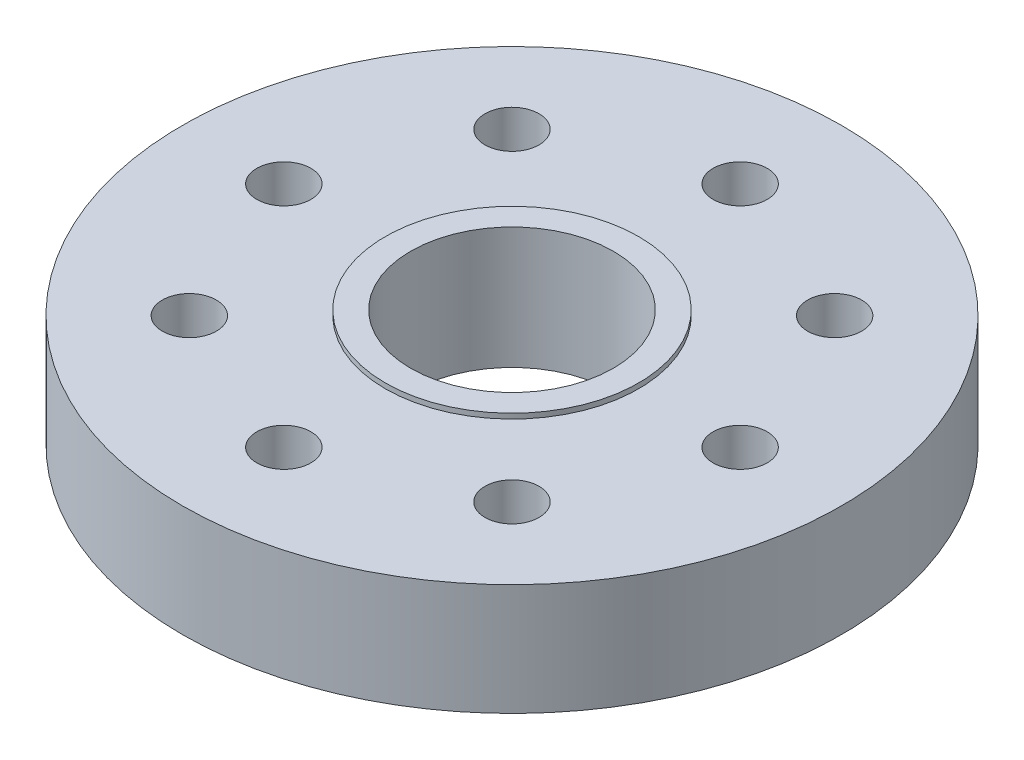
ISO-10303-21;
HEADER;
FILE_DESCRIPTION(('STEP AP214'),'2;1');
FILE_NAME('part.step','',(''),(''),'','','');
FILE_SCHEMA(('AUTOMOTIVE_DESIGN { 1 0 10303 214 1 1 1 1 }'));
ENDSEC;
DATA;
#1=APPLICATION_CONTEXT('core data for automotive mechanical design processes');
#2=APPLICATION_PROTOCOL_DEFINITION('international standard','automotive_design',2000,#1);
#3=PRODUCT_CONTEXT('',#1,'mechanical');
#4=PRODUCT('Part','Part','',(#3));
#5=PRODUCT_RELATED_PRODUCT_CATEGORY('part','',(#4));
#6=PRODUCT_DEFINITION_FORMATION('','',#4);
#7=PRODUCT_DEFINITION_CONTEXT('part definition',#1,'design');
#8=PRODUCT_DEFINITION('design','',#6,#7);
#9=PRODUCT_DEFINITION_SHAPE('','',#8);
#10=(LENGTH_UNIT() NAMED_UNIT(*) SI_UNIT(.MILLI.,.METRE.));
#11=(NAMED_UNIT(*) PLANE_ANGLE_UNIT() SI_UNIT($,.RADIAN.));
#12=(NAMED_UNIT(*) SI_UNIT($,.STERADIAN.) SOLID_ANGLE_UNIT());
#13=UNCERTAINTY_MEASURE_WITH_UNIT(LENGTH_MEASURE(1.E-05),#10,'distance_accuracy_value','');
#14=(GEOMETRIC_REPRESENTATION_CONTEXT(3) GLOBAL_UNCERTAINTY_ASSIGNED_CONTEXT((#13)) GLOBAL_UNIT_ASSIGNED_CONTEXT((#10,
#11,#12)) REPRESENTATION_CONTEXT('',''));
#15=CARTESIAN_POINT('',(0.,0.,0.));
#16=DIRECTION('',(0.,0.,1.));
#17=DIRECTION('',(1.,0.,0.));
#18=AXIS2_PLACEMENT_3D('',#15,#16,#17);
#19=CARTESIAN_POINT('',(0.,-1.65,0.));
#20=DIRECTION('',(0.,1.,0.));
#21=DIRECTION('',(0.,0.,1.));
#22=AXIS2_PLACEMENT_3D('',#19,#20,#21);
#23=PLANE('',#22);
#24=CARTESIAN_POINT('',(-4.7729707730092,-1.65,-4.7729707730092));
#25=DIRECTION('',(0.,1.,0.));
#26=DIRECTION('',(0.,0.,1.));
#27=AXIS2_PLACEMENT_3D('',#24,#25,#26);
#28=CIRCLE('',#27,0.8);
#29=CARTESIAN_POINT('',(-4.7729707730092,-1.65,-3.97297077300919));
#30=VERTEX_POINT('',#29);
#31=EDGE_CURVE('E261',#30,#30,#28,.T.);
#32=ORIENTED_EDGE('',*,*,#31,.T.);
#33=EDGE_LOOP('',(#32));
#34=FACE_BOUND('',#33,.T.);
#35=CARTESIAN_POINT('',(0.,-1.65,0.));
#36=DIRECTION('',(0.,-1.,0.));
#37=DIRECTION('',(0.,0.,-1.));
#38=AXIS2_PLACEMENT_3D('',#35,#36,#37);
#39=CIRCLE('',#38,4.4);
#40=CARTESIAN_POINT('',(-3.57052525047409,-1.65,-2.57125444787694));
#41=VERTEX_POINT('',#40);
#42=CARTESIAN_POINT('',(-3.02772373375921,-1.65,-3.19263041895413));
#43=VERTEX_POINT('',#42);
#44=EDGE_CURVE('E147',#41,#43,#39,.T.);
#45=ORIENTED_EDGE('',*,*,#44,.F.);
#46=CARTESIAN_POINT('',(-4.77297077300901,-1.65,-4.16941738241638));
#47=DIRECTION('',(0.,-1.,0.));
#48=DIRECTION('',(0.,0.,-1.));
#49=AXIS2_PLACEMENT_3D('',#46,#47,#48);
#50=CIRCLE('',#49,2.);
#51=EDGE_CURVE('E133',#41,#43,#50,.T.);
#52=ORIENTED_EDGE('',*,*,#51,.T.);
#53=EDGE_LOOP('',(#45,#52));
#54=FACE_BOUND('',#53,.T.);
#55=ADVANCED_FACE('F36',(#34,#54),#23,.F.);
#56=CARTESIAN_POINT('',(0.,-1.65,-6.75));
#57=DIRECTION('',(0.,1.,0.));
#58=DIRECTION('',(0.,0.,1.));
#59=AXIS2_PLACEMENT_3D('',#56,#57,#58);
#60=CIRCLE('',#59,0.8);
#61=CARTESIAN_POINT('',(0.,-1.65,-5.95));
#62=VERTEX_POINT('',#61);
#63=EDGE_CURVE('E270',#62,#62,#60,.T.);
#64=ORIENTED_EDGE('',*,*,#63,.T.);
#65=EDGE_LOOP('',(#64));
#66=FACE_BOUND('',#65,.T.);
#67=CARTESIAN_POINT('',(-0.571997114225685,-1.65,-4.36266195129963));
#68=VERTEX_POINT('',#67);
#69=CARTESIAN_POINT('',(0.327362601773109,-1.65,-4.38780511497039));
#70=VERTEX_POINT('',#69);
#71=EDGE_CURVE('E140',#68,#70,#39,.T.);
#72=ORIENTED_EDGE('',*,*,#71,.F.);
#73=CARTESIAN_POINT('',(-0.176776695296367,-1.65,-6.32322330470363));
#74=DIRECTION('',(0.,-1.,0.));
#75=DIRECTION('',(0.,0.,-1.));
#76=AXIS2_PLACEMENT_3D('',#73,#74,#75);
#77=CIRCLE('',#76,2.);
#78=EDGE_CURVE('E125',#68,#70,#77,.T.);
#79=ORIENTED_EDGE('',*,*,#78,.T.);
#80=EDGE_LOOP('',(#72,#79));
#81=FACE_BOUND('',#80,.T.);
#82=ADVANCED_FACE('F146',(#66,#81),#23,.F.);
#83=CARTESIAN_POINT('',(-6.75,-1.65,0.));
#84=DIRECTION('',(0.,1.,0.));
#85=DIRECTION('',(0.,0.,1.));
#86=AXIS2_PLACEMENT_3D('',#83,#84,#85);
#87=CIRCLE('',#86,0.800000000000001);
#88=CARTESIAN_POINT('',(-6.75,-1.65,0.800000000000001));
#89=VERTEX_POINT('',#88);
#90=EDGE_CURVE('E273',#89,#89,#87,.T.);
#91=ORIENTED_EDGE('',*,*,#90,.T.);
#92=EDGE_LOOP('',(#91));
#93=FACE_BOUND('',#92,.T.);
#94=CARTESIAN_POINT('',(-6.5,-1.65,0.603553390592734));
#95=DIRECTION('',(0.,-1.,0.));
#96=DIRECTION('',(0.,0.,-1.));
#97=AXIS2_PLACEMENT_3D('',#94,#95,#96);
#98=CIRCLE('',#97,2.);
#99=CARTESIAN_POINT('',(-6.5,-1.65,-1.39644660940727));
#100=VERTEX_POINT('',#99);
#101=EDGE_CURVE('E198',#100,#100,#98,.T.);
#102=ORIENTED_EDGE('',*,*,#101,.T.);
#103=EDGE_LOOP('',(#102));
#104=FACE_BOUND('',#103,.T.);
#105=ADVANCED_FACE('F290',(#93,#104),#23,.F.);
#106=CARTESIAN_POINT('',(0.,-1.65,0.));
#107=DIRECTION('',(0.,1.,0.));
#108=DIRECTION('',(0.,0.,1.));
#109=AXIS2_PLACEMENT_3D('',#106,#107,#108);
#110=CIRCLE('',#109,9.75);
#111=CARTESIAN_POINT('',(0.,-1.65,9.75));
#112=VERTEX_POINT('',#111);
#113=EDGE_CURVE('E40',#112,#112,#110,.T.);
#114=ORIENTED_EDGE('',*,*,#113,.F.);
#115=EDGE_LOOP('',(#114));
#116=FACE_BOUND('',#115,.T.);
#117=CARTESIAN_POINT('',(6.75,-1.65,0.));
#118=DIRECTION('',(0.,1.,0.));
#119=DIRECTION('',(0.,0.,1.));
#120=AXIS2_PLACEMENT_3D('',#117,#118,#119);
#121=CIRCLE('',#120,0.800000000000001);
#122=CARTESIAN_POINT('',(6.75,-1.65,0.800000000000001));
#123=VERTEX_POINT('',#122);
#124=EDGE_CURVE('E278',#123,#123,#121,.T.);
#125=ORIENTED_EDGE('',*,*,#124,.T.);
#126=EDGE_LOOP('',(#125));
#127=FACE_BOUND('',#126,.T.);
#128=CARTESIAN_POINT('',(0.,-1.65,6.75));
#129=DIRECTION('',(0.,1.,0.));
#130=DIRECTION('',(0.,0.,1.));
#131=AXIS2_PLACEMENT_3D('',#128,#129,#130);
#132=CIRCLE('',#131,0.8);
#133=CARTESIAN_POINT('',(0.,-1.65,7.55));
#134=VERTEX_POINT('',#133);
#135=EDGE_CURVE('E276',#134,#134,#132,.T.);
#136=ORIENTED_EDGE('',*,*,#135,.T.);
#137=EDGE_LOOP('',(#136));
#138=FACE_BOUND('',#137,.T.);
#139=CARTESIAN_POINT('',(4.7729707730092,-1.65,4.7729707730092));
#140=DIRECTION('',(0.,1.,0.));
#141=DIRECTION('',(0.,0.,1.));
#142=AXIS2_PLACEMENT_3D('',#139,#140,#141);
#143=CIRCLE('',#142,0.800000000000001);
#144=CARTESIAN_POINT('',(4.7729707730092,-1.65,5.5729707730092));
#145=VERTEX_POINT('',#144);
#146=EDGE_CURVE('E267',#145,#145,#143,.T.);
#147=ORIENTED_EDGE('',*,*,#146,.T.);
#148=EDGE_LOOP('',(#147));
#149=FACE_BOUND('',#148,.T.);
#150=CARTESIAN_POINT('',(-4.7729707730092,-1.65,4.7729707730092));
#151=DIRECTION('',(0.,1.,0.));
#152=DIRECTION('',(0.,0.,1.));
#153=AXIS2_PLACEMENT_3D('',#150,#151,#152);
#154=CIRCLE('',#153,0.8);
#155=CARTESIAN_POINT('',(-4.7729707730092,-1.65,5.5729707730092));
#156=VERTEX_POINT('',#155);
#157=EDGE_CURVE('E264',#156,#156,#154,.T.);
#158=ORIENTED_EDGE('',*,*,#157,.T.);
#159=EDGE_LOOP('',(#158));
#160=FACE_BOUND('',#159,.T.);
#161=CARTESIAN_POINT('',(5.022970773009,-1.65,4.77297077300912));
#162=DIRECTION('',(0.,-1.,0.));
#163=DIRECTION('',(0.,0.,-1.));
#164=AXIS2_PLACEMENT_3D('',#161,#162,#163);
#165=CIRCLE('',#164,2.);
#166=CARTESIAN_POINT('',(5.23241979418587,-1.65,6.76197331386422));
#167=VERTEX_POINT('',#166);
#168=CARTESIAN_POINT('',(7.02006772981787,-1.65,4.88069145396119));
#169=VERTEX_POINT('',#168);
#170=EDGE_CURVE('E53',#167,#169,#165,.T.);
#171=ORIENTED_EDGE('',*,*,#170,.T.);
#172=CARTESIAN_POINT('',(0.,-1.65,0.));
#173=DIRECTION('',(0.,-1.,0.));
#174=DIRECTION('',(0.,0.,-1.));
#175=AXIS2_PLACEMENT_3D('',#172,#173,#174);
#176=CIRCLE('',#175,8.55);
#177=CARTESIAN_POINT('',(8.49370370370371,-1.65,0.979539378325329));
#178=VERTEX_POINT('',#177);
#179=EDGE_CURVE('E187',#178,#169,#176,.T.);
#180=ORIENTED_EDGE('',*,*,#179,.F.);
#181=CARTESIAN_POINT('',(6.75,-1.65,0.));
#182=DIRECTION('',(0.,-1.,0.));
#183=DIRECTION('',(0.,0.,-1.));
#184=AXIS2_PLACEMENT_3D('',#181,#182,#183);
#185=CIRCLE('',#184,2.);
#186=CARTESIAN_POINT('',(8.49370370370371,-1.65,-0.979539378325329));
#187=VERTEX_POINT('',#186);
#188=EDGE_CURVE('E195',#178,#187,#185,.T.);
#189=ORIENTED_EDGE('',*,*,#188,.T.);
#190=CARTESIAN_POINT('',(-6.23877532911509,-1.65,5.8463819916958));
#191=VERTEX_POINT('',#190);
#192=EDGE_CURVE('E194',#191,#187,#176,.T.);
#193=ORIENTED_EDGE('',*,*,#192,.F.);
#194=CARTESIAN_POINT('',(-4.34619407771275,-1.65,5.19974746830537));
#195=DIRECTION('',(0.,-1.,0.));
#196=DIRECTION('',(0.,0.,-1.));
#197=AXIS2_PLACEMENT_3D('',#194,#195,#196);
#198=CIRCLE('',#197,2.);
#199=CARTESIAN_POINT('',(-4.64680378421073,-1.65,7.17702686291788));
#200=VERTEX_POINT('',#199);
#201=EDGE_CURVE('E191',#191,#200,#198,.T.);
#202=ORIENTED_EDGE('',*,*,#201,.T.);
#203=CARTESIAN_POINT('',(-0.790935859810123,-1.65,8.51333779816509));
#204=VERTEX_POINT('',#203);
#205=EDGE_CURVE('E188',#204,#200,#176,.T.);
#206=ORIENTED_EDGE('',*,*,#205,.F.);
#207=CARTESIAN_POINT('',(0.426776695296365,-1.65,6.92677669529637));
#208=DIRECTION('',(0.,-1.,0.));
#209=DIRECTION('',(0.,0.,-1.));
#210=AXIS2_PLACEMENT_3D('',#207,#208,#209);
#211=CIRCLE('',#210,2.);
#212=CARTESIAN_POINT('',(1.83004401429714,-1.65,8.3518524236085));
#213=VERTEX_POINT('',#212);
#214=EDGE_CURVE('E186',#204,#213,#211,.T.);
#215=ORIENTED_EDGE('',*,*,#214,.T.);
#216=EDGE_CURVE('E183',#167,#213,#176,.T.);
#217=ORIENTED_EDGE('',*,*,#216,.F.);
#218=EDGE_LOOP('',(#171,#180,#189,#193,#202,#206,#215,#217));
#219=FACE_BOUND('',#218,.T.);
#220=ADVANCED_FACE('F287',(#116,#127,#138,#149,#160,#219),#23,.F.);
#221=CARTESIAN_POINT('',(4.77297077300919,-1.65,-4.7729707730092));
#222=DIRECTION('',(0.,1.,0.));
#223=DIRECTION('',(0.,0.,1.));
#224=AXIS2_PLACEMENT_3D('',#221,#222,#223);
#225=CIRCLE('',#224,0.800000000000001);
#226=CARTESIAN_POINT('',(4.77297077300919,-1.65,-3.9729707730092));
#227=VERTEX_POINT('',#226);
#228=EDGE_CURVE('E235',#227,#227,#225,.T.);
#229=ORIENTED_EDGE('',*,*,#228,.T.);
#230=EDGE_LOOP('',(#229));
#231=FACE_BOUND('',#230,.T.);
#232=CARTESIAN_POINT('',(4.59619407771275,-1.65,-4.59619407771264));
#233=DIRECTION('',(0.,-1.,0.));
#234=DIRECTION('',(0.,0.,-1.));
#235=AXIS2_PLACEMENT_3D('',#232,#233,#234);
#236=CIRCLE('',#235,2.);
#237=CARTESIAN_POINT('',(4.59619407771275,-1.65,-6.59619407771264));
#238=VERTEX_POINT('',#237);
#239=EDGE_CURVE('E156',#238,#238,#236,.T.);
#240=ORIENTED_EDGE('',*,*,#239,.T.);
#241=EDGE_LOOP('',(#240));
#242=FACE_BOUND('',#241,.T.);
#243=ADVANCED_FACE('F289',(#231,#242),#23,.F.);
#244=CARTESIAN_POINT('',(0.,1.65,0.));
#245=DIRECTION('',(0.,-1.,0.));
#246=DIRECTION('',(0.,0.,-1.));
#247=AXIS2_PLACEMENT_3D('',#244,#245,#246);
#248=CYLINDRICAL_SURFACE('',#247,9.75);
#249=CARTESIAN_POINT('',(0.,1.65,0.));
#250=DIRECTION('',(0.,1.,0.));
#251=DIRECTION('',(0.,0.,1.));
#252=AXIS2_PLACEMENT_3D('',#249,#250,#251);
#253=CIRCLE('',#252,9.75);
#254=CARTESIAN_POINT('',(0.,1.65,9.75));
#255=VERTEX_POINT('',#254);
#256=EDGE_CURVE('E11',#255,#255,#253,.T.);
#257=ORIENTED_EDGE('',*,*,#256,.F.);
#258=EDGE_LOOP('',(#257));
#259=FACE_BOUND('',#258,.T.);
#260=ORIENTED_EDGE('',*,*,#113,.T.);
#261=EDGE_LOOP('',(#260));
#262=FACE_BOUND('',#261,.T.);
#263=ADVANCED_FACE('F285',(#259,#262),#248,.T.);
#264=CARTESIAN_POINT('',(6.75,1.65,0.));
#265=DIRECTION('',(0.,-1.,0.));
#266=DIRECTION('',(0.,0.,-1.));
#267=AXIS2_PLACEMENT_3D('',#264,#265,#266);
#268=CYLINDRICAL_SURFACE('',#267,0.800000000000001);
#269=CARTESIAN_POINT('',(6.75,1.65,0.));
#270=DIRECTION('',(0.,1.,0.));
#271=DIRECTION('',(0.,0.,1.));
#272=AXIS2_PLACEMENT_3D('',#269,#270,#271);
#273=CIRCLE('',#272,0.800000000000001);
#274=CARTESIAN_POINT('',(6.75,1.65,0.800000000000001));
#275=VERTEX_POINT('',#274);
#276=EDGE_CURVE('E45',#275,#275,#273,.T.);
#277=ORIENTED_EDGE('',*,*,#276,.T.);
#278=EDGE_LOOP('',(#277));
#279=FACE_BOUND('',#278,.T.);
#280=ORIENTED_EDGE('',*,*,#124,.F.);
#281=EDGE_LOOP('',(#280));
#282=FACE_BOUND('',#281,.T.);
#283=ADVANCED_FACE('F372',(#279,#282),#268,.F.);
#284=CARTESIAN_POINT('',(0.,1.65,6.75));
#285=DIRECTION('',(0.,-1.,0.));
#286=DIRECTION('',(0.,0.,-1.));
#287=AXIS2_PLACEMENT_3D('',#284,#285,#286);
#288=CYLINDRICAL_SURFACE('',#287,0.8);
#289=CARTESIAN_POINT('',(0.,1.65,6.75));
#290=DIRECTION('',(0.,1.,0.));
#291=DIRECTION('',(0.,0.,1.));
#292=AXIS2_PLACEMENT_3D('',#289,#290,#291);
#293=CIRCLE('',#292,0.8);
#294=CARTESIAN_POINT('',(0.,1.65,7.55));
#295=VERTEX_POINT('',#294);
#296=EDGE_CURVE('E254',#295,#295,#293,.T.);
#297=ORIENTED_EDGE('',*,*,#296,.T.);
#298=EDGE_LOOP('',(#297));
#299=FACE_BOUND('',#298,.T.);
#300=ORIENTED_EDGE('',*,*,#135,.F.);
#301=EDGE_LOOP('',(#300));
#302=FACE_BOUND('',#301,.T.);
#303=ADVANCED_FACE('F452',(#299,#302),#288,.F.);
#304=CARTESIAN_POINT('',(-6.75,1.65,0.));
#305=DIRECTION('',(0.,-1.,0.));
#306=DIRECTION('',(0.,0.,-1.));
#307=AXIS2_PLACEMENT_3D('',#304,#305,#306);
#308=CYLINDRICAL_SURFACE('',#307,0.800000000000001);
#309=CARTESIAN_POINT('',(-6.75,1.65,0.));
#310=DIRECTION('',(0.,1.,0.));
#311=DIRECTION('',(0.,0.,1.));
#312=AXIS2_PLACEMENT_3D('',#309,#310,#311);
#313=CIRCLE('',#312,0.800000000000001);
#314=CARTESIAN_POINT('',(-6.75,1.65,0.800000000000001));
#315=VERTEX_POINT('',#314);
#316=EDGE_CURVE('E251',#315,#315,#313,.T.);
#317=ORIENTED_EDGE('',*,*,#316,.T.);
#318=EDGE_LOOP('',(#317));
#319=FACE_BOUND('',#318,.T.);
#320=ORIENTED_EDGE('',*,*,#90,.F.);
#321=EDGE_LOOP('',(#320));
#322=FACE_BOUND('',#321,.T.);
#323=ADVANCED_FACE('F457',(#319,#322),#308,.F.);
#324=CARTESIAN_POINT('',(0.,1.65,-6.75));
#325=DIRECTION('',(0.,-1.,0.));
#326=DIRECTION('',(0.,0.,-1.));
#327=AXIS2_PLACEMENT_3D('',#324,#325,#326);
#328=CYLINDRICAL_SURFACE('',#327,0.8);
#329=CARTESIAN_POINT('',(0.,1.65,-6.75));
#330=DIRECTION('',(0.,1.,0.));
#331=DIRECTION('',(0.,0.,1.));
#332=AXIS2_PLACEMENT_3D('',#329,#330,#331);
#333=CIRCLE('',#332,0.8);
#334=CARTESIAN_POINT('',(0.,1.65,-5.95));
#335=VERTEX_POINT('',#334);
#336=EDGE_CURVE('E248',#335,#335,#333,.T.);
#337=ORIENTED_EDGE('',*,*,#336,.T.);
#338=EDGE_LOOP('',(#337));
#339=FACE_BOUND('',#338,.T.);
#340=ORIENTED_EDGE('',*,*,#63,.F.);
#341=EDGE_LOOP('',(#340));
#342=FACE_BOUND('',#341,.T.);
#343=ADVANCED_FACE('F463',(#339,#342),#328,.F.);
#344=CARTESIAN_POINT('',(4.7729707730092,1.65,4.7729707730092));
#345=DIRECTION('',(0.,-1.,0.));
#346=DIRECTION('',(0.,0.,-1.));
#347=AXIS2_PLACEMENT_3D('',#344,#345,#346);
#348=CYLINDRICAL_SURFACE('',#347,0.800000000000001);
#349=CARTESIAN_POINT('',(4.7729707730092,1.65,4.7729707730092));
#350=DIRECTION('',(0.,1.,0.));
#351=DIRECTION('',(0.,0.,1.));
#352=AXIS2_PLACEMENT_3D('',#349,#350,#351);
#353=CIRCLE('',#352,0.800000000000001);
#354=CARTESIAN_POINT('',(4.7729707730092,1.65,5.5729707730092));
#355=VERTEX_POINT('',#354);
#356=EDGE_CURVE('E245',#355,#355,#353,.T.);
#357=ORIENTED_EDGE('',*,*,#356,.T.);
#358=EDGE_LOOP('',(#357));
#359=FACE_BOUND('',#358,.T.);
#360=ORIENTED_EDGE('',*,*,#146,.F.);
#361=EDGE_LOOP('',(#360));
#362=FACE_BOUND('',#361,.T.);
#363=ADVANCED_FACE('F467',(#359,#362),#348,.F.);
#364=CARTESIAN_POINT('',(-4.7729707730092,1.65,4.7729707730092));
#365=DIRECTION('',(0.,-1.,0.));
#366=DIRECTION('',(0.,0.,-1.));
#367=AXIS2_PLACEMENT_3D('',#364,#365,#366);
#368=CYLINDRICAL_SURFACE('',#367,0.8);
#369=CARTESIAN_POINT('',(-4.7729707730092,1.65,4.7729707730092));
#370=DIRECTION('',(0.,1.,0.));
#371=DIRECTION('',(0.,0.,1.));
#372=AXIS2_PLACEMENT_3D('',#369,#370,#371);
#373=CIRCLE('',#372,0.8);
#374=CARTESIAN_POINT('',(-4.7729707730092,1.65,5.5729707730092));
#375=VERTEX_POINT('',#374);
#376=EDGE_CURVE('E242',#375,#375,#373,.T.);
#377=ORIENTED_EDGE('',*,*,#376,.T.);
#378=EDGE_LOOP('',(#377));
#379=FACE_BOUND('',#378,.T.);
#380=ORIENTED_EDGE('',*,*,#157,.F.);
#381=EDGE_LOOP('',(#380));
#382=FACE_BOUND('',#381,.T.);
#383=ADVANCED_FACE('F471',(#379,#382),#368,.F.);
#384=CARTESIAN_POINT('',(-4.7729707730092,1.65,-4.7729707730092));
#385=DIRECTION('',(0.,-1.,0.));
#386=DIRECTION('',(0.,0.,-1.));
#387=AXIS2_PLACEMENT_3D('',#384,#385,#386);
#388=CYLINDRICAL_SURFACE('',#387,0.8);
#389=CARTESIAN_POINT('',(-4.7729707730092,1.65,-4.7729707730092));
#390=DIRECTION('',(0.,1.,0.));
#391=DIRECTION('',(0.,0.,1.));
#392=AXIS2_PLACEMENT_3D('',#389,#390,#391);
#393=CIRCLE('',#392,0.8);
#394=CARTESIAN_POINT('',(-4.7729707730092,1.65,-3.97297077300919));
#395=VERTEX_POINT('',#394);
#396=EDGE_CURVE('E239',#395,#395,#393,.T.);
#397=ORIENTED_EDGE('',*,*,#396,.T.);
#398=EDGE_LOOP('',(#397));
#399=FACE_BOUND('',#398,.T.);
#400=ORIENTED_EDGE('',*,*,#31,.F.);
#401=EDGE_LOOP('',(#400));
#402=FACE_BOUND('',#401,.T.);
#403=ADVANCED_FACE('F428',(#399,#402),#388,.F.);
#404=CARTESIAN_POINT('',(4.77297077300919,1.65,-4.7729707730092));
#405=DIRECTION('',(0.,-1.,0.));
#406=DIRECTION('',(0.,0.,-1.));
#407=AXIS2_PLACEMENT_3D('',#404,#405,#406);
#408=CYLINDRICAL_SURFACE('',#407,0.800000000000001);
#409=CARTESIAN_POINT('',(4.77297077300919,1.65,-4.7729707730092));
#410=DIRECTION('',(0.,1.,0.));
#411=DIRECTION('',(0.,0.,1.));
#412=AXIS2_PLACEMENT_3D('',#409,#410,#411);
#413=CIRCLE('',#412,0.800000000000001);
#414=CARTESIAN_POINT('',(4.77297077300919,1.65,-3.9729707730092));
#415=VERTEX_POINT('',#414);
#416=EDGE_CURVE('E236',#415,#415,#413,.T.);
#417=ORIENTED_EDGE('',*,*,#416,.T.);
#418=EDGE_LOOP('',(#417));
#419=FACE_BOUND('',#418,.T.);
#420=ORIENTED_EDGE('',*,*,#228,.F.);
#421=EDGE_LOOP('',(#420));
#422=FACE_BOUND('',#421,.T.);
#423=ADVANCED_FACE('F38',(#419,#422),#408,.F.);
#424=CARTESIAN_POINT('',(0.,1.65,0.));
#425=DIRECTION('',(0.,1.,0.));
#426=DIRECTION('',(0.,0.,1.));
#427=AXIS2_PLACEMENT_3D('',#424,#425,#426);
#428=PLANE('',#427);
#429=CARTESIAN_POINT('',(0.,1.65,0.));
#430=DIRECTION('',(0.,1.,0.));
#431=DIRECTION('',(0.,0.,1.));
#432=AXIS2_PLACEMENT_3D('',#429,#430,#431);
#433=CIRCLE('',#432,3.75);
#434=CARTESIAN_POINT('',(0.,1.65,3.75));
#435=VERTEX_POINT('',#434);
#436=EDGE_CURVE('E230',#435,#435,#433,.F.);
#437=ORIENTED_EDGE('',*,*,#436,.T.);
#438=EDGE_LOOP('',(#437));
#439=FACE_BOUND('',#438,.T.);
#440=ORIENTED_EDGE('',*,*,#416,.F.);
#441=EDGE_LOOP('',(#440));
#442=FACE_BOUND('',#441,.T.);
#443=ORIENTED_EDGE('',*,*,#396,.F.);
#444=EDGE_LOOP('',(#443));
#445=FACE_BOUND('',#444,.T.);
#446=ORIENTED_EDGE('',*,*,#376,.F.);
#447=EDGE_LOOP('',(#446));
#448=FACE_BOUND('',#447,.T.);
#449=ORIENTED_EDGE('',*,*,#356,.F.);
#450=EDGE_LOOP('',(#449));
#451=FACE_BOUND('',#450,.T.);
#452=ORIENTED_EDGE('',*,*,#336,.F.);
#453=EDGE_LOOP('',(#452));
#454=FACE_BOUND('',#453,.T.);
#455=ORIENTED_EDGE('',*,*,#316,.F.);
#456=EDGE_LOOP('',(#455));
#457=FACE_BOUND('',#456,.T.);
#458=ORIENTED_EDGE('',*,*,#296,.F.);
#459=EDGE_LOOP('',(#458));
#460=FACE_BOUND('',#459,.T.);
#461=ORIENTED_EDGE('',*,*,#276,.F.);
#462=EDGE_LOOP('',(#461));
#463=FACE_BOUND('',#462,.T.);
#464=ORIENTED_EDGE('',*,*,#256,.T.);
#465=EDGE_LOOP('',(#464));
#466=FACE_BOUND('',#465,.T.);
#467=ADVANCED_FACE('F419',(#439,#442,#445,#448,#451,#454,#457,#460,#463,#466),#428,.T.);
#468=CARTESIAN_POINT('',(0.,-1.8,0.));
#469=DIRECTION('',(0.,1.,0.));
#470=DIRECTION('',(0.,0.,1.));
#471=AXIS2_PLACEMENT_3D('',#468,#469,#470);
#472=PLANE('',#471);
#473=CARTESIAN_POINT('',(0.,-1.8,0.));
#474=DIRECTION('',(0.,1.,0.));
#475=DIRECTION('',(0.,0.,1.));
#476=AXIS2_PLACEMENT_3D('',#473,#474,#475);
#477=CIRCLE('',#476,3.);
#478=CARTESIAN_POINT('',(0.,-1.8,3.));
#479=VERTEX_POINT('',#478);
#480=EDGE_CURVE('E205',#479,#479,#477,.T.);
#481=ORIENTED_EDGE('',*,*,#480,.T.);
#482=EDGE_LOOP('',(#481));
#483=FACE_BOUND('',#482,.T.);
#484=CARTESIAN_POINT('',(0.,-1.8,0.));
#485=DIRECTION('',(0.,-1.,0.));
#486=DIRECTION('',(0.,0.,-1.));
#487=AXIS2_PLACEMENT_3D('',#484,#485,#486);
#488=CIRCLE('',#487,4.4);
#489=CARTESIAN_POINT('',(0.,-1.8,-4.4));
#490=VERTEX_POINT('',#489);
#491=EDGE_CURVE('E134',#490,#490,#488,.T.);
#492=ORIENTED_EDGE('',*,*,#491,.T.);
#493=EDGE_LOOP('',(#492));
#494=FACE_BOUND('',#493,.T.);
#495=ADVANCED_FACE('F415',(#483,#494),#472,.F.);
#496=CARTESIAN_POINT('',(0.,1.65,0.));
#497=DIRECTION('',(0.,-1.,0.));
#498=DIRECTION('',(0.,0.,-1.));
#499=AXIS2_PLACEMENT_3D('',#496,#497,#498);
#500=CYLINDRICAL_SURFACE('',#499,3.);
#501=ORIENTED_EDGE('',*,*,#480,.F.);
#502=EDGE_LOOP('',(#501));
#503=FACE_BOUND('',#502,.T.);
#504=CARTESIAN_POINT('',(0.,1.8,0.));
#505=DIRECTION('',(0.,1.,0.));
#506=DIRECTION('',(0.,0.,1.));
#507=AXIS2_PLACEMENT_3D('',#504,#505,#506);
#508=CIRCLE('',#507,3.);
#509=CARTESIAN_POINT('',(0.,1.8,3.));
#510=VERTEX_POINT('',#509);
#511=EDGE_CURVE('E224',#510,#510,#508,.T.);
#512=ORIENTED_EDGE('',*,*,#511,.T.);
#513=EDGE_LOOP('',(#512));
#514=FACE_BOUND('',#513,.T.);
#515=ADVANCED_FACE('F418',(#503,#514),#500,.F.);
#516=CARTESIAN_POINT('',(0.,1.8,0.));
#517=DIRECTION('',(0.,-1.,0.));
#518=DIRECTION('',(0.,0.,-1.));
#519=AXIS2_PLACEMENT_3D('',#516,#517,#518);
#520=CYLINDRICAL_SURFACE('',#519,3.75);
#521=ORIENTED_EDGE('',*,*,#436,.F.);
#522=EDGE_LOOP('',(#521));
#523=FACE_BOUND('',#522,.T.);
#524=CARTESIAN_POINT('',(0.,1.8,0.));
#525=DIRECTION('',(0.,1.,0.));
#526=DIRECTION('',(0.,0.,1.));
#527=AXIS2_PLACEMENT_3D('',#524,#525,#526);
#528=CIRCLE('',#527,3.75);
#529=CARTESIAN_POINT('',(0.,1.8,3.75));
#530=VERTEX_POINT('',#529);
#531=EDGE_CURVE('E227',#530,#530,#528,.T.);
#532=ORIENTED_EDGE('',*,*,#531,.F.);
#533=EDGE_LOOP('',(#532));
#534=FACE_BOUND('',#533,.T.);
#535=ADVANCED_FACE('F413',(#523,#534),#520,.T.);
#536=CARTESIAN_POINT('',(0.,1.8,0.));
#537=DIRECTION('',(0.,1.,0.));
#538=DIRECTION('',(0.,0.,1.));
#539=AXIS2_PLACEMENT_3D('',#536,#537,#538);
#540=PLANE('',#539);
#541=ORIENTED_EDGE('',*,*,#511,.F.);
#542=EDGE_LOOP('',(#541));
#543=FACE_BOUND('',#542,.T.);
#544=ORIENTED_EDGE('',*,*,#531,.T.);
#545=EDGE_LOOP('',(#544));
#546=FACE_BOUND('',#545,.T.);
#547=ADVANCED_FACE('F347',(#543,#546),#540,.T.);
#548=CARTESIAN_POINT('',(5.022970773009,0.15,4.77297077300912));
#549=DIRECTION('',(0.,-1.,0.));
#550=DIRECTION('',(0.,0.,-1.));
#551=AXIS2_PLACEMENT_3D('',#548,#549,#550);
#552=CYLINDRICAL_SURFACE('',#551,2.);
#553=ORIENTED_EDGE('',*,*,#170,.F.);
#554=DIRECTION('',(0.,-1.,0.));
#555=VECTOR('',#554,1.);
#556=CARTESIAN_POINT('',(5.23241979418587,0.15,6.76197331386422));
#557=LINE('',#556,#555);
#558=CARTESIAN_POINT('',(5.23241979418587,0.15,6.76197331386422));
#559=VERTEX_POINT('',#558);
#560=EDGE_CURVE('E218',#559,#167,#557,.T.);
#561=ORIENTED_EDGE('',*,*,#560,.F.);
#562=CARTESIAN_POINT('',(5.022970773009,0.15,4.77297077300912));
#563=DIRECTION('',(0.,-1.,0.));
#564=DIRECTION('',(0.,0.,-1.));
#565=AXIS2_PLACEMENT_3D('',#562,#563,#564);
#566=CIRCLE('',#565,2.);
#567=CARTESIAN_POINT('',(7.02006772981787,0.15,4.88069145396119));
#568=VERTEX_POINT('',#567);
#569=EDGE_CURVE('E160',#559,#568,#566,.T.);
#570=ORIENTED_EDGE('',*,*,#569,.T.);
#571=DIRECTION('',(0.,-1.,0.));
#572=VECTOR('',#571,1.);
#573=CARTESIAN_POINT('',(7.02006772981787,0.15,4.88069145396119));
#574=LINE('',#573,#572);
#575=EDGE_CURVE('E203',#568,#169,#574,.T.);
#576=ORIENTED_EDGE('',*,*,#575,.T.);
#577=EDGE_LOOP('',(#553,#561,#570,#576));
#578=FACE_BOUND('',#577,.T.);
#579=ADVANCED_FACE('F309',(#578),#552,.T.);
#580=CARTESIAN_POINT('',(0.,0.15,0.));
#581=DIRECTION('',(0.,-1.,0.));
#582=DIRECTION('',(0.,0.,-1.));
#583=AXIS2_PLACEMENT_3D('',#580,#581,#582);
#584=CYLINDRICAL_SURFACE('',#583,8.55);
#585=ORIENTED_EDGE('',*,*,#179,.T.);
#586=ORIENTED_EDGE('',*,*,#575,.F.);
#587=CARTESIAN_POINT('',(0.,0.15,0.));
#588=DIRECTION('',(0.,-1.,0.));
#589=DIRECTION('',(0.,0.,-1.));
#590=AXIS2_PLACEMENT_3D('',#587,#588,#589);
#591=CIRCLE('',#590,8.55);
#592=CARTESIAN_POINT('',(8.49370370370371,0.15,0.979539378325329));
#593=VERTEX_POINT('',#592);
#594=EDGE_CURVE('E166',#593,#568,#591,.T.);
#595=ORIENTED_EDGE('',*,*,#594,.F.);
#596=DIRECTION('',(0.,-1.,0.));
#597=VECTOR('',#596,1.);
#598=CARTESIAN_POINT('',(8.49370370370371,0.15,0.979539378325329));
#599=LINE('',#598,#597);
#600=EDGE_CURVE('E206',#593,#178,#599,.T.);
#601=ORIENTED_EDGE('',*,*,#600,.T.);
#602=EDGE_LOOP('',(#585,#586,#595,#601));
#603=FACE_BOUND('',#602,.T.);
#604=ADVANCED_FACE('F339',(#603),#584,.F.);
#605=CARTESIAN_POINT('',(6.75,0.15,0.));
#606=DIRECTION('',(0.,-1.,0.));
#607=DIRECTION('',(0.,0.,-1.));
#608=AXIS2_PLACEMENT_3D('',#605,#606,#607);
#609=CYLINDRICAL_SURFACE('',#608,2.);
#610=ORIENTED_EDGE('',*,*,#188,.F.);
#611=ORIENTED_EDGE('',*,*,#600,.F.);
#612=CARTESIAN_POINT('',(6.75,0.15,0.));
#613=DIRECTION('',(0.,-1.,0.));
#614=DIRECTION('',(0.,0.,-1.));
#615=AXIS2_PLACEMENT_3D('',#612,#613,#614);
#616=CIRCLE('',#615,2.);
#617=CARTESIAN_POINT('',(8.49370370370371,0.15,-0.979539378325329));
#618=VERTEX_POINT('',#617);
#619=EDGE_CURVE('E172',#593,#618,#616,.T.);
#620=ORIENTED_EDGE('',*,*,#619,.T.);
#621=DIRECTION('',(0.,-1.,0.));
#622=VECTOR('',#621,1.);
#623=CARTESIAN_POINT('',(8.49370370370371,0.15,-0.979539378325329));
#624=LINE('',#623,#622);
#625=EDGE_CURVE('E208',#618,#187,#624,.T.);
#626=ORIENTED_EDGE('',*,*,#625,.T.);
#627=EDGE_LOOP('',(#610,#611,#620,#626));
#628=FACE_BOUND('',#627,.T.);
#629=ADVANCED_FACE('F338',(#628),#609,.T.);
#630=ORIENTED_EDGE('',*,*,#192,.T.);
#631=ORIENTED_EDGE('',*,*,#625,.F.);
#632=CARTESIAN_POINT('',(-6.23877532911509,0.15,5.8463819916958));
#633=VERTEX_POINT('',#632);
#634=EDGE_CURVE('E171',#633,#618,#591,.T.);
#635=ORIENTED_EDGE('',*,*,#634,.F.);
#636=DIRECTION('',(0.,-1.,0.));
#637=VECTOR('',#636,1.);
#638=CARTESIAN_POINT('',(-6.23877532911509,0.15,5.8463819916958));
#639=LINE('',#638,#637);
#640=EDGE_CURVE('E210',#633,#191,#639,.T.);
#641=ORIENTED_EDGE('',*,*,#640,.T.);
#642=EDGE_LOOP('',(#630,#631,#635,#641));
#643=FACE_BOUND('',#642,.T.);
#644=ADVANCED_FACE('F334',(#643),#584,.F.);
#645=CARTESIAN_POINT('',(-4.34619407771275,0.15,5.19974746830537));
#646=DIRECTION('',(0.,-1.,0.));
#647=DIRECTION('',(0.,0.,-1.));
#648=AXIS2_PLACEMENT_3D('',#645,#646,#647);
#649=CYLINDRICAL_SURFACE('',#648,2.);
#650=ORIENTED_EDGE('',*,*,#201,.F.);
#651=ORIENTED_EDGE('',*,*,#640,.F.);
#652=CARTESIAN_POINT('',(-4.34619407771275,0.15,5.19974746830537));
#653=DIRECTION('',(0.,-1.,0.));
#654=DIRECTION('',(0.,0.,-1.));
#655=AXIS2_PLACEMENT_3D('',#652,#653,#654);
#656=CIRCLE('',#655,2.);
#657=CARTESIAN_POINT('',(-4.64680378421073,0.15,7.17702686291788));
#658=VERTEX_POINT('',#657);
#659=EDGE_CURVE('E169',#633,#658,#656,.T.);
#660=ORIENTED_EDGE('',*,*,#659,.T.);
#661=DIRECTION('',(0.,-1.,0.));
#662=VECTOR('',#661,1.);
#663=CARTESIAN_POINT('',(-4.64680378421073,0.15,7.17702686291788));
#664=LINE('',#663,#662);
#665=EDGE_CURVE('E212',#658,#200,#664,.T.);
#666=ORIENTED_EDGE('',*,*,#665,.T.);
#667=EDGE_LOOP('',(#650,#651,#660,#666));
#668=FACE_BOUND('',#667,.T.);
#669=ADVANCED_FACE('F330',(#668),#649,.T.);
#670=ORIENTED_EDGE('',*,*,#205,.T.);
#671=ORIENTED_EDGE('',*,*,#665,.F.);
#672=CARTESIAN_POINT('',(-0.790935859810123,0.15,8.51333779816509));
#673=VERTEX_POINT('',#672);
#674=EDGE_CURVE('E167',#673,#658,#591,.T.);
#675=ORIENTED_EDGE('',*,*,#674,.F.);
#676=DIRECTION('',(0.,-1.,0.));
#677=VECTOR('',#676,1.);
#678=CARTESIAN_POINT('',(-0.790935859810123,0.15,8.51333779816509));
#679=LINE('',#678,#677);
#680=EDGE_CURVE('E214',#673,#204,#679,.T.);
#681=ORIENTED_EDGE('',*,*,#680,.T.);
#682=EDGE_LOOP('',(#670,#671,#675,#681));
#683=FACE_BOUND('',#682,.T.);
#684=ADVANCED_FACE('F327',(#683),#584,.F.);
#685=CARTESIAN_POINT('',(0.426776695296365,0.15,6.92677669529637));
#686=DIRECTION('',(0.,-1.,0.));
#687=DIRECTION('',(0.,0.,-1.));
#688=AXIS2_PLACEMENT_3D('',#685,#686,#687);
#689=CYLINDRICAL_SURFACE('',#688,2.);
#690=ORIENTED_EDGE('',*,*,#214,.F.);
#691=ORIENTED_EDGE('',*,*,#680,.F.);
#692=CARTESIAN_POINT('',(0.426776695296365,0.15,6.92677669529637));
#693=DIRECTION('',(0.,-1.,0.));
#694=DIRECTION('',(0.,0.,-1.));
#695=AXIS2_PLACEMENT_3D('',#692,#693,#694);
#696=CIRCLE('',#695,2.);
#697=CARTESIAN_POINT('',(1.83004401429714,0.15,8.3518524236085));
#698=VERTEX_POINT('',#697);
#699=EDGE_CURVE('E165',#673,#698,#696,.T.);
#700=ORIENTED_EDGE('',*,*,#699,.T.);
#701=DIRECTION('',(0.,-1.,0.));
#702=VECTOR('',#701,1.);
#703=CARTESIAN_POINT('',(1.83004401429714,0.15,8.3518524236085));
#704=LINE('',#703,#702);
#705=EDGE_CURVE('E216',#698,#213,#704,.T.);
#706=ORIENTED_EDGE('',*,*,#705,.T.);
#707=EDGE_LOOP('',(#690,#691,#700,#706));
#708=FACE_BOUND('',#707,.T.);
#709=ADVANCED_FACE('F406',(#708),#689,.T.);
#710=CARTESIAN_POINT('',(0.,0.15,0.));
#711=DIRECTION('',(0.,-1.,0.));
#712=DIRECTION('',(0.,0.,-1.));
#713=AXIS2_PLACEMENT_3D('',#710,#711,#712);
#714=CYLINDRICAL_SURFACE('',#713,4.4);
#715=DIRECTION('',(0.,-1.,0.));
#716=VECTOR('',#715,1.);
#717=CARTESIAN_POINT('',(-3.57052525047409,0.15,-2.57125444787694));
#718=LINE('',#717,#716);
#719=CARTESIAN_POINT('',(-3.57052525047409,0.15,-2.57125444787694));
#720=VERTEX_POINT('',#719);
#721=EDGE_CURVE('E220',#720,#41,#718,.T.);
#722=ORIENTED_EDGE('',*,*,#721,.T.);
#723=ORIENTED_EDGE('',*,*,#44,.T.);
#724=DIRECTION('',(0.,-1.,0.));
#725=VECTOR('',#724,1.);
#726=CARTESIAN_POINT('',(-3.02772373375921,0.15,-3.19263041895413));
#727=LINE('',#726,#725);
#728=CARTESIAN_POINT('',(-3.02772373375921,0.15,-3.19263041895413));
#729=VERTEX_POINT('',#728);
#730=EDGE_CURVE('E144',#729,#43,#727,.T.);
#731=ORIENTED_EDGE('',*,*,#730,.F.);
#732=CARTESIAN_POINT('',(0.,0.15,0.));
#733=DIRECTION('',(0.,-1.,0.));
#734=DIRECTION('',(0.,0.,-1.));
#735=AXIS2_PLACEMENT_3D('',#732,#733,#734);
#736=CIRCLE('',#735,4.4);
#737=CARTESIAN_POINT('',(-0.571997114225681,0.15,-4.36266195129963));
#738=VERTEX_POINT('',#737);
#739=EDGE_CURVE('E143',#729,#738,#736,.T.);
#740=ORIENTED_EDGE('',*,*,#739,.T.);
#741=DIRECTION('',(0.,-1.,0.));
#742=VECTOR('',#741,1.);
#743=CARTESIAN_POINT('',(-0.571997114225681,0.15,-4.36266195129963));
#744=LINE('',#743,#742);
#745=EDGE_CURVE('E128',#738,#68,#744,.T.);
#746=ORIENTED_EDGE('',*,*,#745,.T.);
#747=ORIENTED_EDGE('',*,*,#71,.T.);
#748=DIRECTION('',(0.,-1.,0.));
#749=VECTOR('',#748,1.);
#750=CARTESIAN_POINT('',(0.327362601773109,0.15,-4.38780511497039));
#751=LINE('',#750,#749);
#752=CARTESIAN_POINT('',(0.327362601773109,0.15,-4.38780511497039));
#753=VERTEX_POINT('',#752);
#754=EDGE_CURVE('E61',#753,#70,#751,.T.);
#755=ORIENTED_EDGE('',*,*,#754,.F.);
#756=EDGE_CURVE('E152',#753,#720,#736,.T.);
#757=ORIENTED_EDGE('',*,*,#756,.T.);
#758=EDGE_LOOP('',(#722,#723,#731,#740,#746,#747,#755,#757));
#759=FACE_BOUND('',#758,.T.);
#760=ORIENTED_EDGE('',*,*,#491,.F.);
#761=EDGE_LOOP('',(#760));
#762=FACE_BOUND('',#761,.T.);
#763=ADVANCED_FACE('F138',(#759,#762),#714,.T.);
#764=CARTESIAN_POINT('',(-4.77297077300901,0.15,-4.16941738241638));
#765=DIRECTION('',(0.,-1.,0.));
#766=DIRECTION('',(0.,0.,-1.));
#767=AXIS2_PLACEMENT_3D('',#764,#765,#766);
#768=CYLINDRICAL_SURFACE('',#767,2.);
#769=ORIENTED_EDGE('',*,*,#51,.F.);
#770=ORIENTED_EDGE('',*,*,#721,.F.);
#771=CARTESIAN_POINT('',(-4.77297077300901,0.15,-4.16941738241638));
#772=DIRECTION('',(0.,-1.,0.));
#773=DIRECTION('',(0.,0.,-1.));
#774=AXIS2_PLACEMENT_3D('',#771,#772,#773);
#775=CIRCLE('',#774,2.);
#776=EDGE_CURVE('E158',#720,#729,#775,.T.);
#777=ORIENTED_EDGE('',*,*,#776,.T.);
#778=ORIENTED_EDGE('',*,*,#730,.T.);
#779=EDGE_LOOP('',(#769,#770,#777,#778));
#780=FACE_BOUND('',#779,.T.);
#781=ADVANCED_FACE('F391',(#780),#768,.T.);
#782=CARTESIAN_POINT('',(-6.5,0.15,0.603553390592734));
#783=DIRECTION('',(0.,-1.,0.));
#784=DIRECTION('',(0.,0.,-1.));
#785=AXIS2_PLACEMENT_3D('',#782,#783,#784);
#786=CYLINDRICAL_SURFACE('',#785,2.);
#787=CARTESIAN_POINT('',(-6.5,0.15,0.603553390592734));
#788=DIRECTION('',(0.,-1.,0.));
#789=DIRECTION('',(0.,0.,-1.));
#790=AXIS2_PLACEMENT_3D('',#787,#788,#789);
#791=CIRCLE('',#790,2.);
#792=CARTESIAN_POINT('',(-6.5,0.15,-1.39644660940727));
#793=VERTEX_POINT('',#792);
#794=EDGE_CURVE('E174',#793,#793,#791,.T.);
#795=ORIENTED_EDGE('',*,*,#794,.T.);
#796=EDGE_LOOP('',(#795));
#797=FACE_BOUND('',#796,.T.);
#798=ORIENTED_EDGE('',*,*,#101,.F.);
#799=EDGE_LOOP('',(#798));
#800=FACE_BOUND('',#799,.T.);
#801=ADVANCED_FACE('F351',(#797,#800),#786,.T.);
#802=ORIENTED_EDGE('',*,*,#216,.T.);
#803=ORIENTED_EDGE('',*,*,#705,.F.);
#804=EDGE_CURVE('E162',#559,#698,#591,.T.);
#805=ORIENTED_EDGE('',*,*,#804,.F.);
#806=ORIENTED_EDGE('',*,*,#560,.T.);
#807=EDGE_LOOP('',(#802,#803,#805,#806));
#808=FACE_BOUND('',#807,.T.);
#809=ADVANCED_FACE('F306',(#808),#584,.F.);
#810=CARTESIAN_POINT('',(-0.176776695296367,0.15,-6.32322330470363));
#811=DIRECTION('',(0.,-1.,0.));
#812=DIRECTION('',(0.,0.,-1.));
#813=AXIS2_PLACEMENT_3D('',#810,#811,#812);
#814=CYLINDRICAL_SURFACE('',#813,2.);
#815=ORIENTED_EDGE('',*,*,#78,.F.);
#816=ORIENTED_EDGE('',*,*,#745,.F.);
#817=CARTESIAN_POINT('',(-0.176776695296367,0.15,-6.32322330470363));
#818=DIRECTION('',(0.,-1.,0.));
#819=DIRECTION('',(0.,0.,-1.));
#820=AXIS2_PLACEMENT_3D('',#817,#818,#819);
#821=CIRCLE('',#820,2.);
#822=EDGE_CURVE('E155',#738,#753,#821,.T.);
#823=ORIENTED_EDGE('',*,*,#822,.T.);
#824=ORIENTED_EDGE('',*,*,#754,.T.);
#825=EDGE_LOOP('',(#815,#816,#823,#824));
#826=FACE_BOUND('',#825,.T.);
#827=ADVANCED_FACE('F127',(#826),#814,.T.);
#828=CARTESIAN_POINT('',(4.59619407771275,0.15,-4.59619407771264));
#829=DIRECTION('',(0.,-1.,0.));
#830=DIRECTION('',(0.,0.,-1.));
#831=AXIS2_PLACEMENT_3D('',#828,#829,#830);
#832=CYLINDRICAL_SURFACE('',#831,2.);
#833=CARTESIAN_POINT('',(4.59619407771275,0.15,-4.59619407771264));
#834=DIRECTION('',(0.,-1.,0.));
#835=DIRECTION('',(0.,0.,-1.));
#836=AXIS2_PLACEMENT_3D('',#833,#834,#835);
#837=CIRCLE('',#836,2.);
#838=CARTESIAN_POINT('',(4.59619407771275,0.15,-6.59619407771264));
#839=VERTEX_POINT('',#838);
#840=EDGE_CURVE('E177',#839,#839,#837,.T.);
#841=ORIENTED_EDGE('',*,*,#840,.T.);
#842=EDGE_LOOP('',(#841));
#843=FACE_BOUND('',#842,.T.);
#844=ORIENTED_EDGE('',*,*,#239,.F.);
#845=EDGE_LOOP('',(#844));
#846=FACE_BOUND('',#845,.T.);
#847=ADVANCED_FACE('F379',(#843,#846),#832,.T.);
#848=CARTESIAN_POINT('',(0.,0.15,0.));
#849=DIRECTION('',(0.,-1.,0.));
#850=DIRECTION('',(0.,0.,-1.));
#851=AXIS2_PLACEMENT_3D('',#848,#849,#850);
#852=PLANE('',#851);
#853=ORIENTED_EDGE('',*,*,#756,.F.);
#854=ORIENTED_EDGE('',*,*,#822,.F.);
#855=ORIENTED_EDGE('',*,*,#739,.F.);
#856=ORIENTED_EDGE('',*,*,#776,.F.);
#857=EDGE_LOOP('',(#853,#854,#855,#856));
#858=FACE_BOUND('',#857,.T.);
#859=ORIENTED_EDGE('',*,*,#569,.F.);
#860=ORIENTED_EDGE('',*,*,#804,.T.);
#861=ORIENTED_EDGE('',*,*,#699,.F.);
#862=ORIENTED_EDGE('',*,*,#674,.T.);
#863=ORIENTED_EDGE('',*,*,#659,.F.);
#864=ORIENTED_EDGE('',*,*,#634,.T.);
#865=ORIENTED_EDGE('',*,*,#619,.F.);
#866=ORIENTED_EDGE('',*,*,#594,.T.);
#867=EDGE_LOOP('',(#859,#860,#861,#862,#863,#864,#865,#866));
#868=FACE_BOUND('',#867,.T.);
#869=ORIENTED_EDGE('',*,*,#794,.F.);
#870=EDGE_LOOP('',(#869));
#871=FACE_BOUND('',#870,.T.);
#872=ORIENTED_EDGE('',*,*,#840,.F.);
#873=EDGE_LOOP('',(#872));
#874=FACE_BOUND('',#873,.T.);
#875=ADVANCED_FACE('F313',(#858,#868,#871,#874),#852,.T.);
#876=CLOSED_SHELL('',(#55,#82,#105,#220,#243,#263,#283,#303,#323,#343,#363,#383,#403,#423,#467,
#495,#515,#535,#547,#579,#604,#629,#644,#669,#684,#709,#763,#781,#801,#809,#827,#847,#875));
#877=MANIFOLD_SOLID_BREP('B2',#876);
#878=ADVANCED_BREP_SHAPE_REPRESENTATION('',(#18,#877),#14);
#879=SHAPE_DEFINITION_REPRESENTATION(#9,#878);
ENDSEC;
END-ISO-10303-21;
